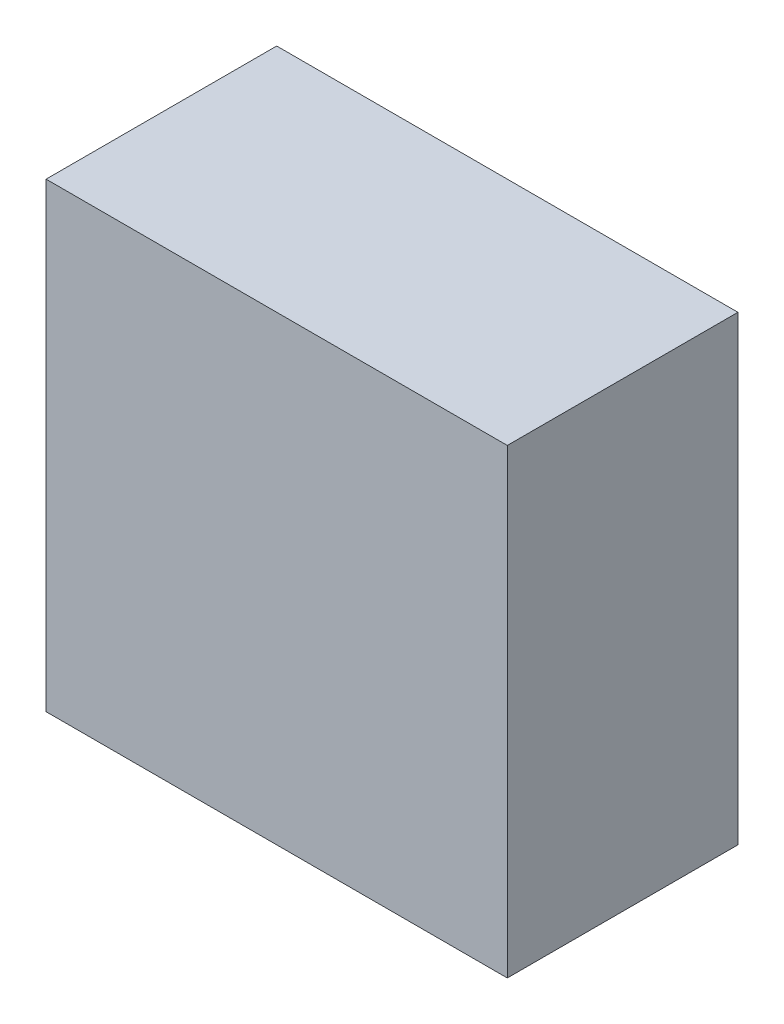
ISO-10303-21;
HEADER;
FILE_DESCRIPTION(('STEP AP214'),'2;1');
FILE_NAME('part.step','',(''),(''),'','','');
FILE_SCHEMA(('AUTOMOTIVE_DESIGN { 1 0 10303 214 1 1 1 1 }'));
ENDSEC;
DATA;
#1=APPLICATION_CONTEXT('core data for automotive mechanical design processes');
#2=APPLICATION_PROTOCOL_DEFINITION('international standard','automotive_design',2000,#1);
#3=PRODUCT_CONTEXT('',#1,'mechanical');
#4=PRODUCT('Part','Part','',(#3));
#5=PRODUCT_RELATED_PRODUCT_CATEGORY('part','',(#4));
#6=PRODUCT_DEFINITION_FORMATION('','',#4);
#7=PRODUCT_DEFINITION_CONTEXT('part definition',#1,'design');
#8=PRODUCT_DEFINITION('design','',#6,#7);
#9=PRODUCT_DEFINITION_SHAPE('','',#8);
#10=(LENGTH_UNIT() NAMED_UNIT(*) SI_UNIT(.MILLI.,.METRE.));
#11=(NAMED_UNIT(*) PLANE_ANGLE_UNIT() SI_UNIT($,.RADIAN.));
#12=(NAMED_UNIT(*) SI_UNIT($,.STERADIAN.) SOLID_ANGLE_UNIT());
#13=UNCERTAINTY_MEASURE_WITH_UNIT(LENGTH_MEASURE(1.E-05),#10,'distance_accuracy_value','');
#14=(GEOMETRIC_REPRESENTATION_CONTEXT(3) GLOBAL_UNCERTAINTY_ASSIGNED_CONTEXT((#13)) GLOBAL_UNIT_ASSIGNED_CONTEXT((#10,
#11,#12)) REPRESENTATION_CONTEXT('',''));
#15=CARTESIAN_POINT('',(0.,0.,0.));
#16=DIRECTION('',(0.,0.,1.));
#17=DIRECTION('',(1.,0.,0.));
#18=AXIS2_PLACEMENT_3D('',#15,#16,#17);
#19=CARTESIAN_POINT('',(0.,0.,2.75));
#20=DIRECTION('',(0.,0.,-1.));
#21=DIRECTION('',(-1.,0.,0.));
#22=AXIS2_PLACEMENT_3D('',#19,#20,#21);
#23=PLANE('',#22);
#24=DIRECTION('',(1.,0.,0.));
#25=VECTOR('',#24,1.);
#26=CARTESIAN_POINT('',(158.313158045854,112.929115844304,2.75));
#27=LINE('',#26,#25);
#28=CARTESIAN_POINT('',(158.313158045854,112.929115844304,2.75));
#29=VERTEX_POINT('',#28);
#30=CARTESIAN_POINT('',(154.313158045854,112.929115844304,2.75));
#31=VERTEX_POINT('',#30);
#32=EDGE_CURVE('E80',#29,#31,#27,.F.);
#33=ORIENTED_EDGE('',*,*,#32,.T.);
#34=DIRECTION('',(0.,1.,0.));
#35=VECTOR('',#34,1.);
#36=CARTESIAN_POINT('',(154.313158045854,112.929115844304,2.75));
#37=LINE('',#36,#35);
#38=CARTESIAN_POINT('',(154.313158045854,108.929115844304,2.75));
#39=VERTEX_POINT('',#38);
#40=EDGE_CURVE('E55',#31,#39,#37,.F.);
#41=ORIENTED_EDGE('',*,*,#40,.T.);
#42=DIRECTION('',(1.,0.,0.));
#43=VECTOR('',#42,1.);
#44=CARTESIAN_POINT('',(158.313158045854,108.929115844304,2.75));
#45=LINE('',#44,#43);
#46=CARTESIAN_POINT('',(158.313158045854,108.929115844304,2.75));
#47=VERTEX_POINT('',#46);
#48=EDGE_CURVE('E57',#39,#47,#45,.T.);
#49=ORIENTED_EDGE('',*,*,#48,.T.);
#50=DIRECTION('',(0.,1.,0.));
#51=VECTOR('',#50,1.);
#52=CARTESIAN_POINT('',(158.313158045854,112.929115844304,2.75));
#53=LINE('',#52,#51);
#54=EDGE_CURVE('E20',#47,#29,#53,.T.);
#55=ORIENTED_EDGE('',*,*,#54,.T.);
#56=EDGE_LOOP('',(#33,#41,#49,#55));
#57=FACE_BOUND('',#56,.T.);
#58=ADVANCED_FACE('F17',(#57),#23,.F.);
#59=CARTESIAN_POINT('',(158.313158045854,112.929115844304,2.75));
#60=DIRECTION('',(-1.,0.,0.));
#61=DIRECTION('',(0.,0.,1.));
#62=AXIS2_PLACEMENT_3D('',#59,#60,#61);
#63=PLANE('',#62);
#64=DIRECTION('',(0.,0.,-1.));
#65=VECTOR('',#64,1.);
#66=CARTESIAN_POINT('',(158.313158045854,112.929115844304,2.75));
#67=LINE('',#66,#65);
#68=CARTESIAN_POINT('',(158.313158045854,112.929115844304,0.75));
#69=VERTEX_POINT('',#68);
#70=EDGE_CURVE('E68',#69,#29,#67,.F.);
#71=ORIENTED_EDGE('',*,*,#70,.T.);
#72=ORIENTED_EDGE('',*,*,#54,.F.);
#73=DIRECTION('',(0.,0.,1.));
#74=VECTOR('',#73,1.);
#75=CARTESIAN_POINT('',(158.313158045854,108.929115844304,2.75));
#76=LINE('',#75,#74);
#77=CARTESIAN_POINT('',(158.313158045854,108.929115844304,0.75));
#78=VERTEX_POINT('',#77);
#79=EDGE_CURVE('E63',#47,#78,#76,.F.);
#80=ORIENTED_EDGE('',*,*,#79,.T.);
#81=DIRECTION('',(0.,1.,0.));
#82=VECTOR('',#81,1.);
#83=CARTESIAN_POINT('',(158.313158045854,0.,0.75));
#84=LINE('',#83,#82);
#85=EDGE_CURVE('E83',#69,#78,#84,.F.);
#86=ORIENTED_EDGE('',*,*,#85,.F.);
#87=EDGE_LOOP('',(#71,#72,#80,#86));
#88=FACE_BOUND('',#87,.T.);
#89=ADVANCED_FACE('F65',(#88),#63,.F.);
#90=CARTESIAN_POINT('',(158.313158045854,108.929115844304,2.75));
#91=DIRECTION('',(0.,1.,0.));
#92=DIRECTION('',(0.,0.,1.));
#93=AXIS2_PLACEMENT_3D('',#90,#91,#92);
#94=PLANE('',#93);
#95=ORIENTED_EDGE('',*,*,#79,.F.);
#96=ORIENTED_EDGE('',*,*,#48,.F.);
#97=DIRECTION('',(0.,0.,-1.));
#98=VECTOR('',#97,1.);
#99=CARTESIAN_POINT('',(154.313158045854,108.929115844304,2.75));
#100=LINE('',#99,#98);
#101=CARTESIAN_POINT('',(154.313158045854,108.929115844304,0.75));
#102=VERTEX_POINT('',#101);
#103=EDGE_CURVE('E75',#39,#102,#100,.T.);
#104=ORIENTED_EDGE('',*,*,#103,.T.);
#105=DIRECTION('',(-1.,0.,0.));
#106=VECTOR('',#105,1.);
#107=CARTESIAN_POINT('',(0.,108.929115844304,0.75));
#108=LINE('',#107,#106);
#109=EDGE_CURVE('E72',#78,#102,#108,.T.);
#110=ORIENTED_EDGE('',*,*,#109,.F.);
#111=EDGE_LOOP('',(#95,#96,#104,#110));
#112=FACE_BOUND('',#111,.T.);
#113=ADVANCED_FACE('F70',(#112),#94,.F.);
#114=CARTESIAN_POINT('',(154.313158045854,112.929115844304,2.75));
#115=DIRECTION('',(1.,0.,0.));
#116=DIRECTION('',(0.,0.,-1.));
#117=AXIS2_PLACEMENT_3D('',#114,#115,#116);
#118=PLANE('',#117);
#119=ORIENTED_EDGE('',*,*,#103,.F.);
#120=ORIENTED_EDGE('',*,*,#40,.F.);
#121=DIRECTION('',(0.,0.,-1.));
#122=VECTOR('',#121,1.);
#123=CARTESIAN_POINT('',(154.313158045854,112.929115844304,2.75));
#124=LINE('',#123,#122);
#125=CARTESIAN_POINT('',(154.313158045854,112.929115844304,0.75));
#126=VERTEX_POINT('',#125);
#127=EDGE_CURVE('E35',#31,#126,#124,.T.);
#128=ORIENTED_EDGE('',*,*,#127,.T.);
#129=DIRECTION('',(0.,1.,0.));
#130=VECTOR('',#129,1.);
#131=CARTESIAN_POINT('',(154.313158045854,0.,0.75));
#132=LINE('',#131,#130);
#133=EDGE_CURVE('E26',#102,#126,#132,.T.);
#134=ORIENTED_EDGE('',*,*,#133,.F.);
#135=EDGE_LOOP('',(#119,#120,#128,#134));
#136=FACE_BOUND('',#135,.T.);
#137=ADVANCED_FACE('F89',(#136),#118,.F.);
#138=CARTESIAN_POINT('',(158.313158045854,112.929115844304,2.75));
#139=DIRECTION('',(0.,-1.,0.));
#140=DIRECTION('',(0.,0.,-1.));
#141=AXIS2_PLACEMENT_3D('',#138,#139,#140);
#142=PLANE('',#141);
#143=ORIENTED_EDGE('',*,*,#127,.F.);
#144=ORIENTED_EDGE('',*,*,#32,.F.);
#145=ORIENTED_EDGE('',*,*,#70,.F.);
#146=DIRECTION('',(-1.,0.,0.));
#147=VECTOR('',#146,1.);
#148=CARTESIAN_POINT('',(0.,112.929115844304,0.75));
#149=LINE('',#148,#147);
#150=EDGE_CURVE('E11',#126,#69,#149,.F.);
#151=ORIENTED_EDGE('',*,*,#150,.F.);
#152=EDGE_LOOP('',(#143,#144,#145,#151));
#153=FACE_BOUND('',#152,.T.);
#154=ADVANCED_FACE('F91',(#153),#142,.F.);
#155=CARTESIAN_POINT('',(0.,0.,0.75));
#156=DIRECTION('',(0.,0.,-1.));
#157=DIRECTION('',(-1.,0.,0.));
#158=AXIS2_PLACEMENT_3D('',#155,#156,#157);
#159=PLANE('',#158);
#160=ORIENTED_EDGE('',*,*,#133,.T.);
#161=ORIENTED_EDGE('',*,*,#150,.T.);
#162=ORIENTED_EDGE('',*,*,#85,.T.);
#163=ORIENTED_EDGE('',*,*,#109,.T.);
#164=EDGE_LOOP('',(#160,#161,#162,#163));
#165=FACE_BOUND('',#164,.T.);
#166=ADVANCED_FACE('F88',(#165),#159,.T.);
#167=CLOSED_SHELL('',(#58,#89,#113,#137,#154,#166));
#168=MANIFOLD_SOLID_BREP('B1',#167);
#169=ADVANCED_BREP_SHAPE_REPRESENTATION('',(#18,#168),#14);
#170=SHAPE_DEFINITION_REPRESENTATION(#9,#169);
ENDSEC;
END-ISO-10303-21;
